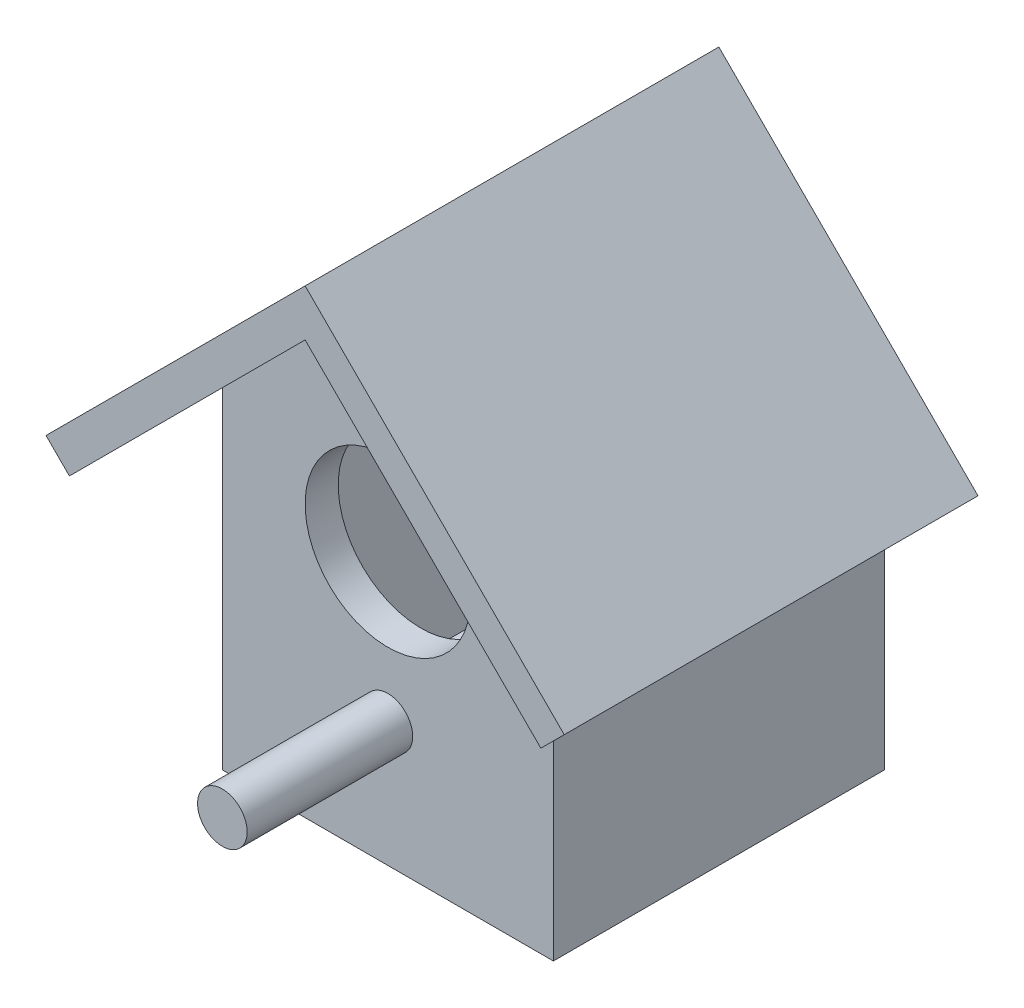
ISO-10303-21;
HEADER;
FILE_DESCRIPTION(('STEP AP214'),'2;1');
FILE_NAME('part.step','',(''),(''),'','','');
FILE_SCHEMA(('AUTOMOTIVE_DESIGN { 1 0 10303 214 1 1 1 1 }'));
ENDSEC;
DATA;
#1=APPLICATION_CONTEXT('core data for automotive mechanical design processes');
#2=APPLICATION_PROTOCOL_DEFINITION('international standard','automotive_design',2000,#1);
#3=PRODUCT_CONTEXT('',#1,'mechanical');
#4=PRODUCT('Part','Part','',(#3));
#5=PRODUCT_RELATED_PRODUCT_CATEGORY('part','',(#4));
#6=PRODUCT_DEFINITION_FORMATION('','',#4);
#7=PRODUCT_DEFINITION_CONTEXT('part definition',#1,'design');
#8=PRODUCT_DEFINITION('design','',#6,#7);
#9=PRODUCT_DEFINITION_SHAPE('','',#8);
#10=(LENGTH_UNIT() NAMED_UNIT(*) SI_UNIT(.MILLI.,.METRE.));
#11=(NAMED_UNIT(*) PLANE_ANGLE_UNIT() SI_UNIT($,.RADIAN.));
#12=(NAMED_UNIT(*) SI_UNIT($,.STERADIAN.) SOLID_ANGLE_UNIT());
#13=UNCERTAINTY_MEASURE_WITH_UNIT(LENGTH_MEASURE(1.E-05),#10,'distance_accuracy_value','');
#14=(GEOMETRIC_REPRESENTATION_CONTEXT(3) GLOBAL_UNCERTAINTY_ASSIGNED_CONTEXT((#13)) GLOBAL_UNIT_ASSIGNED_CONTEXT((#10,
#11,#12)) REPRESENTATION_CONTEXT('',''));
#15=CARTESIAN_POINT('',(0.,0.,0.));
#16=DIRECTION('',(0.,0.,1.));
#17=DIRECTION('',(1.,0.,0.));
#18=AXIS2_PLACEMENT_3D('',#15,#16,#17);
#19=CARTESIAN_POINT('',(100.,75.,180.));
#20=DIRECTION('',(0.,0.,1.));
#21=DIRECTION('',(1.,0.,0.));
#22=AXIS2_PLACEMENT_3D('',#19,#20,#21);
#23=CYLINDRICAL_SURFACE('',#22,15.);
#24=CARTESIAN_POINT('',(100.,75.,180.));
#25=DIRECTION('',(0.,0.,1.));
#26=DIRECTION('',(1.,0.,0.));
#27=AXIS2_PLACEMENT_3D('',#24,#25,#26);
#28=CIRCLE('',#27,15.);
#29=CARTESIAN_POINT('',(115.,75.,180.));
#30=VERTEX_POINT('',#29);
#31=EDGE_CURVE('E11',#30,#30,#28,.T.);
#32=ORIENTED_EDGE('',*,*,#31,.T.);
#33=EDGE_LOOP('',(#32));
#34=FACE_BOUND('',#33,.T.);
#35=CARTESIAN_POINT('',(100.,75.,300.));
#36=DIRECTION('',(0.,0.,1.));
#37=DIRECTION('',(1.,0.,0.));
#38=AXIS2_PLACEMENT_3D('',#35,#36,#37);
#39=CIRCLE('',#38,15.);
#40=CARTESIAN_POINT('',(115.,75.,300.));
#41=VERTEX_POINT('',#40);
#42=EDGE_CURVE('E49',#41,#41,#39,.T.);
#43=ORIENTED_EDGE('',*,*,#42,.F.);
#44=EDGE_LOOP('',(#43));
#45=FACE_BOUND('',#44,.T.);
#46=ADVANCED_FACE('F43',(#34,#45),#23,.T.);
#47=CARTESIAN_POINT('',(100.,75.,180.));
#48=DIRECTION('',(0.,0.,1.));
#49=DIRECTION('',(1.,0.,0.));
#50=AXIS2_PLACEMENT_3D('',#47,#48,#49);
#51=PLANE('',#50);
#52=ORIENTED_EDGE('',*,*,#31,.F.);
#53=EDGE_LOOP('',(#52));
#54=FACE_BOUND('',#53,.T.);
#55=ADVANCED_FACE('F58',(#54),#51,.F.);
#56=CARTESIAN_POINT('',(100.,75.,300.));
#57=DIRECTION('',(0.,0.,1.));
#58=DIRECTION('',(1.,0.,0.));
#59=AXIS2_PLACEMENT_3D('',#56,#57,#58);
#60=PLANE('',#59);
#61=ORIENTED_EDGE('',*,*,#42,.T.);
#62=EDGE_LOOP('',(#61));
#63=FACE_BOUND('',#62,.T.);
#64=ADVANCED_FACE('F55',(#63),#60,.T.);
#65=CLOSED_SHELL('',(#46,#55,#64));
#66=MANIFOLD_SOLID_BREP('B2',#65);
#67=CARTESIAN_POINT('',(180.,0.,200.));
#68=DIRECTION('',(-1.,0.,0.));
#69=DIRECTION('',(0.,0.,1.));
#70=AXIS2_PLACEMENT_3D('',#67,#68,#69);
#71=PLANE('',#70);
#72=DIRECTION('',(0.,0.,-1.));
#73=VECTOR('',#72,1.);
#74=CARTESIAN_POINT('',(180.,20.,200.));
#75=LINE('',#74,#73);
#76=CARTESIAN_POINT('',(180.,20.,180.));
#77=VERTEX_POINT('',#76);
#78=CARTESIAN_POINT('',(180.,20.,20.));
#79=VERTEX_POINT('',#78);
#80=EDGE_CURVE('E281',#77,#79,#75,.T.);
#81=ORIENTED_EDGE('',*,*,#80,.F.);
#82=DIRECTION('',(0.,1.,0.));
#83=VECTOR('',#82,1.);
#84=CARTESIAN_POINT('',(180.,0.,180.));
#85=LINE('',#84,#83);
#86=CARTESIAN_POINT('',(180.,220.,180.));
#87=VERTEX_POINT('',#86);
#88=EDGE_CURVE('E241',#77,#87,#85,.T.);
#89=ORIENTED_EDGE('',*,*,#88,.T.);
#90=DIRECTION('',(0.,0.,-1.));
#91=VECTOR('',#90,1.);
#92=CARTESIAN_POINT('',(180.,220.,200.));
#93=LINE('',#92,#91);
#94=CARTESIAN_POINT('',(180.,220.,20.));
#95=VERTEX_POINT('',#94);
#96=EDGE_CURVE('E99',#87,#95,#93,.T.);
#97=ORIENTED_EDGE('',*,*,#96,.T.);
#98=DIRECTION('',(0.,1.,0.));
#99=VECTOR('',#98,1.);
#100=CARTESIAN_POINT('',(180.,0.,20.));
#101=LINE('',#100,#99);
#102=EDGE_CURVE('E286',#79,#95,#101,.T.);
#103=ORIENTED_EDGE('',*,*,#102,.F.);
#104=EDGE_LOOP('',(#81,#89,#97,#103));
#105=FACE_BOUND('',#104,.T.);
#106=ADVANCED_FACE('F84',(#105),#71,.T.);
#107=CARTESIAN_POINT('',(0.,20.,200.));
#108=DIRECTION('',(0.,1.,0.));
#109=DIRECTION('',(0.,0.,1.));
#110=AXIS2_PLACEMENT_3D('',#107,#108,#109);
#111=PLANE('',#110);
#112=DIRECTION('',(0.,0.,-1.));
#113=VECTOR('',#112,1.);
#114=CARTESIAN_POINT('',(20.0000000000003,20.,200.));
#115=LINE('',#114,#113);
#116=CARTESIAN_POINT('',(20.0000000000003,20.,180.));
#117=VERTEX_POINT('',#116);
#118=CARTESIAN_POINT('',(20.0000000000003,20.,20.));
#119=VERTEX_POINT('',#118);
#120=EDGE_CURVE('E279',#117,#119,#115,.T.);
#121=ORIENTED_EDGE('',*,*,#120,.F.);
#122=DIRECTION('',(1.,0.,0.));
#123=VECTOR('',#122,1.);
#124=CARTESIAN_POINT('',(0.,20.,180.));
#125=LINE('',#124,#123);
#126=EDGE_CURVE('E107',#117,#77,#125,.T.);
#127=ORIENTED_EDGE('',*,*,#126,.T.);
#128=ORIENTED_EDGE('',*,*,#80,.T.);
#129=DIRECTION('',(1.,0.,0.));
#130=VECTOR('',#129,1.);
#131=CARTESIAN_POINT('',(0.,20.,20.));
#132=LINE('',#131,#130);
#133=EDGE_CURVE('E283',#119,#79,#132,.T.);
#134=ORIENTED_EDGE('',*,*,#133,.F.);
#135=EDGE_LOOP('',(#121,#127,#128,#134));
#136=FACE_BOUND('',#135,.T.);
#137=ADVANCED_FACE('F309',(#136),#111,.T.);
#138=CARTESIAN_POINT('',(20.0000000000003,0.,200.));
#139=DIRECTION('',(1.,0.,0.));
#140=DIRECTION('',(0.,1.,0.));
#141=AXIS2_PLACEMENT_3D('',#138,#139,#140);
#142=PLANE('',#141);
#143=DIRECTION('',(0.,0.,-1.));
#144=VECTOR('',#143,1.);
#145=CARTESIAN_POINT('',(20.0000000000003,220.,200.));
#146=LINE('',#145,#144);
#147=CARTESIAN_POINT('',(20.0000000000003,220.,180.));
#148=VERTEX_POINT('',#147);
#149=CARTESIAN_POINT('',(20.0000000000003,220.,20.));
#150=VERTEX_POINT('',#149);
#151=EDGE_CURVE('E277',#148,#150,#146,.T.);
#152=ORIENTED_EDGE('',*,*,#151,.F.);
#153=DIRECTION('',(0.,-1.,0.));
#154=VECTOR('',#153,1.);
#155=CARTESIAN_POINT('',(20.0000000000003,0.,180.));
#156=LINE('',#155,#154);
#157=EDGE_CURVE('E234',#148,#117,#156,.T.);
#158=ORIENTED_EDGE('',*,*,#157,.T.);
#159=ORIENTED_EDGE('',*,*,#120,.T.);
#160=DIRECTION('',(0.,-1.,0.));
#161=VECTOR('',#160,1.);
#162=CARTESIAN_POINT('',(20.0000000000003,0.,20.));
#163=LINE('',#162,#161);
#164=EDGE_CURVE('E41',#150,#119,#163,.T.);
#165=ORIENTED_EDGE('',*,*,#164,.F.);
#166=EDGE_LOOP('',(#152,#158,#159,#165));
#167=FACE_BOUND('',#166,.T.);
#168=ADVANCED_FACE('F308',(#167),#142,.T.);
#169=CARTESIAN_POINT('',(0.,0.,20.));
#170=DIRECTION('',(0.,0.,1.));
#171=DIRECTION('',(1.,0.,0.));
#172=AXIS2_PLACEMENT_3D('',#169,#170,#171);
#173=PLANE('',#172);
#174=ORIENTED_EDGE('',*,*,#133,.T.);
#175=ORIENTED_EDGE('',*,*,#102,.T.);
#176=DIRECTION('',(0.707106781186546,-0.707106781186549,0.));
#177=VECTOR('',#176,1.);
#178=CARTESIAN_POINT('',(200.,200.,20.));
#179=LINE('',#178,#177);
#180=CARTESIAN_POINT('',(100.,300.,20.));
#181=VERTEX_POINT('',#180);
#182=EDGE_CURVE('E289',#181,#95,#179,.T.);
#183=ORIENTED_EDGE('',*,*,#182,.F.);
#184=DIRECTION('',(0.707106781186546,0.707106781186549,0.));
#185=VECTOR('',#184,1.);
#186=CARTESIAN_POINT('',(-100.,99.9999999999997,20.));
#187=LINE('',#186,#185);
#188=EDGE_CURVE('E92',#150,#181,#187,.T.);
#189=ORIENTED_EDGE('',*,*,#188,.F.);
#190=ORIENTED_EDGE('',*,*,#164,.T.);
#191=EDGE_LOOP('',(#174,#175,#183,#189,#190));
#192=FACE_BOUND('',#191,.T.);
#193=ADVANCED_FACE('F299',(#192),#173,.T.);
#194=CARTESIAN_POINT('',(0.,0.,0.));
#195=DIRECTION('',(0.,0.,1.));
#196=DIRECTION('',(1.,0.,0.));
#197=AXIS2_PLACEMENT_3D('',#194,#195,#196);
#198=PLANE('',#197);
#199=DIRECTION('',(0.,-1.,0.));
#200=VECTOR('',#199,1.);
#201=CARTESIAN_POINT('',(0.,0.,0.));
#202=LINE('',#201,#200);
#203=CARTESIAN_POINT('',(0.,200.,0.));
#204=VERTEX_POINT('',#203);
#205=CARTESIAN_POINT('',(0.,0.,0.));
#206=VERTEX_POINT('',#205);
#207=EDGE_CURVE('E236',#204,#206,#202,.T.);
#208=ORIENTED_EDGE('',*,*,#207,.F.);
#209=DIRECTION('',(0.707106781186546,0.707106781186549,0.));
#210=VECTOR('',#209,1.);
#211=CARTESIAN_POINT('',(-100.,99.9999999999997,0.));
#212=LINE('',#211,#210);
#213=CARTESIAN_POINT('',(-42.4264068711928,157.573593128807,0.));
#214=VERTEX_POINT('',#213);
#215=EDGE_CURVE('E334',#214,#204,#212,.T.);
#216=ORIENTED_EDGE('',*,*,#215,.F.);
#217=DIRECTION('',(0.707106781186548,-0.707106781186547,0.));
#218=VECTOR('',#217,1.);
#219=CARTESIAN_POINT('',(57.5735931288072,57.5735931288072,0.));
#220=LINE('',#219,#218);
#221=CARTESIAN_POINT('',(-56.5685424949238,171.715728752538,0.));
#222=VERTEX_POINT('',#221);
#223=EDGE_CURVE('E212',#222,#214,#220,.T.);
#224=ORIENTED_EDGE('',*,*,#223,.F.);
#225=DIRECTION('',(-0.707106781186547,-0.707106781186548,0.));
#226=VECTOR('',#225,1.);
#227=CARTESIAN_POINT('',(-114.142135623731,114.142135623731,0.));
#228=LINE('',#227,#226);
#229=CARTESIAN_POINT('',(100.,328.284271247462,0.));
#230=VERTEX_POINT('',#229);
#231=EDGE_CURVE('E348',#230,#222,#228,.T.);
#232=ORIENTED_EDGE('',*,*,#231,.F.);
#233=DIRECTION('',(-0.707106781186547,0.707106781186548,0.));
#234=VECTOR('',#233,1.);
#235=CARTESIAN_POINT('',(214.142135623731,214.142135623731,0.));
#236=LINE('',#235,#234);
#237=CARTESIAN_POINT('',(256.568542494924,171.715728752538,0.));
#238=VERTEX_POINT('',#237);
#239=EDGE_CURVE('E346',#238,#230,#236,.T.);
#240=ORIENTED_EDGE('',*,*,#239,.F.);
#241=DIRECTION('',(0.707106781186549,0.707106781186546,0.));
#242=VECTOR('',#241,1.);
#243=CARTESIAN_POINT('',(42.4264068711923,-42.4264068711925,0.));
#244=LINE('',#243,#242);
#245=CARTESIAN_POINT('',(242.426406871193,157.573593128807,0.));
#246=VERTEX_POINT('',#245);
#247=EDGE_CURVE('E340',#246,#238,#244,.T.);
#248=ORIENTED_EDGE('',*,*,#247,.F.);
#249=DIRECTION('',(0.707106781186546,-0.707106781186549,0.));
#250=VECTOR('',#249,1.);
#251=CARTESIAN_POINT('',(200.,200.,0.));
#252=LINE('',#251,#250);
#253=CARTESIAN_POINT('',(200.,200.,0.));
#254=VERTEX_POINT('',#253);
#255=EDGE_CURVE('E338',#254,#246,#252,.T.);
#256=ORIENTED_EDGE('',*,*,#255,.F.);
#257=DIRECTION('',(0.,1.,0.));
#258=VECTOR('',#257,1.);
#259=CARTESIAN_POINT('',(200.,0.,0.));
#260=LINE('',#259,#258);
#261=CARTESIAN_POINT('',(200.,0.,0.));
#262=VERTEX_POINT('',#261);
#263=EDGE_CURVE('E252',#262,#254,#260,.T.);
#264=ORIENTED_EDGE('',*,*,#263,.F.);
#265=DIRECTION('',(1.,0.,0.));
#266=VECTOR('',#265,1.);
#267=CARTESIAN_POINT('',(0.,0.,0.));
#268=LINE('',#267,#266);
#269=EDGE_CURVE('E262',#206,#262,#268,.T.);
#270=ORIENTED_EDGE('',*,*,#269,.F.);
#271=EDGE_LOOP('',(#208,#216,#224,#232,#240,#248,#256,#264,#270));
#272=FACE_BOUND('',#271,.T.);
#273=ADVANCED_FACE('F86',(#272),#198,.F.);
#274=CARTESIAN_POINT('',(0.,0.,200.));
#275=DIRECTION('',(1.,0.,0.));
#276=DIRECTION('',(0.,1.,0.));
#277=AXIS2_PLACEMENT_3D('',#274,#275,#276);
#278=PLANE('',#277);
#279=ORIENTED_EDGE('',*,*,#207,.T.);
#280=DIRECTION('',(0.,0.,-1.));
#281=VECTOR('',#280,1.);
#282=CARTESIAN_POINT('',(0.,0.,200.));
#283=LINE('',#282,#281);
#284=CARTESIAN_POINT('',(0.,0.,200.));
#285=VERTEX_POINT('',#284);
#286=EDGE_CURVE('E272',#285,#206,#283,.T.);
#287=ORIENTED_EDGE('',*,*,#286,.F.);
#288=DIRECTION('',(0.,-1.,0.));
#289=VECTOR('',#288,1.);
#290=CARTESIAN_POINT('',(0.,0.,200.));
#291=LINE('',#290,#289);
#292=CARTESIAN_POINT('',(0.,200.,200.));
#293=VERTEX_POINT('',#292);
#294=EDGE_CURVE('E251',#293,#285,#291,.T.);
#295=ORIENTED_EDGE('',*,*,#294,.F.);
#296=DIRECTION('',(0.,0.,-1.));
#297=VECTOR('',#296,1.);
#298=CARTESIAN_POINT('',(0.,200.,200.));
#299=LINE('',#298,#297);
#300=EDGE_CURVE('E275',#293,#204,#299,.T.);
#301=ORIENTED_EDGE('',*,*,#300,.T.);
#302=EDGE_LOOP('',(#279,#287,#295,#301));
#303=FACE_BOUND('',#302,.T.);
#304=ADVANCED_FACE('F323',(#303),#278,.F.);
#305=CARTESIAN_POINT('',(0.,0.,200.));
#306=DIRECTION('',(0.,1.,0.));
#307=DIRECTION('',(0.,0.,1.));
#308=AXIS2_PLACEMENT_3D('',#305,#306,#307);
#309=PLANE('',#308);
#310=ORIENTED_EDGE('',*,*,#269,.T.);
#311=DIRECTION('',(0.,0.,-1.));
#312=VECTOR('',#311,1.);
#313=CARTESIAN_POINT('',(200.,0.,200.));
#314=LINE('',#313,#312);
#315=CARTESIAN_POINT('',(200.,0.,200.));
#316=VERTEX_POINT('',#315);
#317=EDGE_CURVE('E269',#316,#262,#314,.T.);
#318=ORIENTED_EDGE('',*,*,#317,.F.);
#319=DIRECTION('',(1.,0.,0.));
#320=VECTOR('',#319,1.);
#321=CARTESIAN_POINT('',(0.,0.,200.));
#322=LINE('',#321,#320);
#323=EDGE_CURVE('E254',#285,#316,#322,.T.);
#324=ORIENTED_EDGE('',*,*,#323,.F.);
#325=ORIENTED_EDGE('',*,*,#286,.T.);
#326=EDGE_LOOP('',(#310,#318,#324,#325));
#327=FACE_BOUND('',#326,.T.);
#328=ADVANCED_FACE('F328',(#327),#309,.F.);
#329=CARTESIAN_POINT('',(200.,0.,200.));
#330=DIRECTION('',(-1.,0.,0.));
#331=DIRECTION('',(0.,0.,1.));
#332=AXIS2_PLACEMENT_3D('',#329,#330,#331);
#333=PLANE('',#332);
#334=ORIENTED_EDGE('',*,*,#263,.T.);
#335=DIRECTION('',(0.,0.,-1.));
#336=VECTOR('',#335,1.);
#337=CARTESIAN_POINT('',(200.,200.,200.));
#338=LINE('',#337,#336);
#339=CARTESIAN_POINT('',(200.,200.,200.));
#340=VERTEX_POINT('',#339);
#341=EDGE_CURVE('E266',#340,#254,#338,.T.);
#342=ORIENTED_EDGE('',*,*,#341,.F.);
#343=DIRECTION('',(0.,1.,0.));
#344=VECTOR('',#343,1.);
#345=CARTESIAN_POINT('',(200.,0.,200.));
#346=LINE('',#345,#344);
#347=EDGE_CURVE('E256',#316,#340,#346,.T.);
#348=ORIENTED_EDGE('',*,*,#347,.F.);
#349=ORIENTED_EDGE('',*,*,#317,.T.);
#350=EDGE_LOOP('',(#334,#342,#348,#349));
#351=FACE_BOUND('',#350,.T.);
#352=ADVANCED_FACE('F411',(#351),#333,.F.);
#353=CARTESIAN_POINT('',(0.,0.,200.));
#354=DIRECTION('',(0.,0.,1.));
#355=DIRECTION('',(1.,0.,0.));
#356=AXIS2_PLACEMENT_3D('',#353,#354,#355);
#357=PLANE('',#356);
#358=DIRECTION('',(0.707106781186546,-0.707106781186549,0.));
#359=VECTOR('',#358,1.);
#360=CARTESIAN_POINT('',(200.,200.,200.));
#361=LINE('',#360,#359);
#362=CARTESIAN_POINT('',(100.,300.,200.));
#363=VERTEX_POINT('',#362);
#364=EDGE_CURVE('E259',#363,#340,#361,.T.);
#365=ORIENTED_EDGE('',*,*,#364,.F.);
#366=DIRECTION('',(0.707106781186546,0.707106781186549,0.));
#367=VECTOR('',#366,1.);
#368=CARTESIAN_POINT('',(-100.,99.9999999999997,200.));
#369=LINE('',#368,#367);
#370=EDGE_CURVE('E219',#293,#363,#369,.T.);
#371=ORIENTED_EDGE('',*,*,#370,.F.);
#372=ORIENTED_EDGE('',*,*,#294,.T.);
#373=ORIENTED_EDGE('',*,*,#323,.T.);
#374=ORIENTED_EDGE('',*,*,#347,.T.);
#375=EDGE_LOOP('',(#365,#371,#372,#373,#374));
#376=FACE_BOUND('',#375,.T.);
#377=CARTESIAN_POINT('',(100.,75.,200.));
#378=DIRECTION('',(0.,0.,1.));
#379=DIRECTION('',(1.,0.,0.));
#380=AXIS2_PLACEMENT_3D('',#377,#378,#379);
#381=CIRCLE('',#380,15.);
#382=CARTESIAN_POINT('',(115.,75.,200.));
#383=VERTEX_POINT('',#382);
#384=EDGE_CURVE('E230',#383,#383,#381,.T.);
#385=ORIENTED_EDGE('',*,*,#384,.F.);
#386=EDGE_LOOP('',(#385));
#387=FACE_BOUND('',#386,.T.);
#388=CARTESIAN_POINT('',(100.,164.142135623731,200.));
#389=DIRECTION('',(0.,0.,1.));
#390=DIRECTION('',(1.,0.,0.));
#391=AXIS2_PLACEMENT_3D('',#388,#389,#390);
#392=CIRCLE('',#391,50.);
#393=CARTESIAN_POINT('',(150.,164.142135623731,200.));
#394=VERTEX_POINT('',#393);
#395=EDGE_CURVE('E233',#394,#394,#392,.T.);
#396=ORIENTED_EDGE('',*,*,#395,.F.);
#397=EDGE_LOOP('',(#396));
#398=FACE_BOUND('',#397,.T.);
#399=ADVANCED_FACE('F404',(#376,#387,#398),#357,.T.);
#400=CARTESIAN_POINT('',(100.,164.142135623731,200.));
#401=DIRECTION('',(0.,0.,-1.));
#402=DIRECTION('',(-1.,0.,0.));
#403=AXIS2_PLACEMENT_3D('',#400,#401,#402);
#404=CYLINDRICAL_SURFACE('',#403,50.);
#405=ORIENTED_EDGE('',*,*,#395,.T.);
#406=EDGE_LOOP('',(#405));
#407=FACE_BOUND('',#406,.T.);
#408=CARTESIAN_POINT('',(100.,164.142135623731,180.));
#409=DIRECTION('',(0.,0.,1.));
#410=DIRECTION('',(1.,0.,0.));
#411=AXIS2_PLACEMENT_3D('',#408,#409,#410);
#412=CIRCLE('',#411,50.);
#413=CARTESIAN_POINT('',(150.,164.142135623731,180.));
#414=VERTEX_POINT('',#413);
#415=EDGE_CURVE('E224',#414,#414,#412,.T.);
#416=ORIENTED_EDGE('',*,*,#415,.F.);
#417=EDGE_LOOP('',(#416));
#418=FACE_BOUND('',#417,.T.);
#419=ADVANCED_FACE('F401',(#407,#418),#404,.F.);
#420=CARTESIAN_POINT('',(100.,75.,200.));
#421=DIRECTION('',(0.,0.,-1.));
#422=DIRECTION('',(-1.,0.,0.));
#423=AXIS2_PLACEMENT_3D('',#420,#421,#422);
#424=CYLINDRICAL_SURFACE('',#423,15.);
#425=ORIENTED_EDGE('',*,*,#384,.T.);
#426=EDGE_LOOP('',(#425));
#427=FACE_BOUND('',#426,.T.);
#428=CARTESIAN_POINT('',(100.,75.,180.));
#429=DIRECTION('',(0.,0.,1.));
#430=DIRECTION('',(1.,0.,0.));
#431=AXIS2_PLACEMENT_3D('',#428,#429,#430);
#432=CIRCLE('',#431,15.);
#433=CARTESIAN_POINT('',(115.,75.,180.));
#434=VERTEX_POINT('',#433);
#435=EDGE_CURVE('E220',#434,#434,#432,.T.);
#436=ORIENTED_EDGE('',*,*,#435,.F.);
#437=EDGE_LOOP('',(#436));
#438=FACE_BOUND('',#437,.T.);
#439=ADVANCED_FACE('F399',(#427,#438),#424,.F.);
#440=CARTESIAN_POINT('',(0.,0.,180.));
#441=DIRECTION('',(0.,0.,1.));
#442=DIRECTION('',(1.,0.,0.));
#443=AXIS2_PLACEMENT_3D('',#440,#441,#442);
#444=PLANE('',#443);
#445=ORIENTED_EDGE('',*,*,#435,.T.);
#446=EDGE_LOOP('',(#445));
#447=FACE_BOUND('',#446,.T.);
#448=ORIENTED_EDGE('',*,*,#415,.T.);
#449=EDGE_LOOP('',(#448));
#450=FACE_BOUND('',#449,.T.);
#451=ORIENTED_EDGE('',*,*,#126,.F.);
#452=ORIENTED_EDGE('',*,*,#157,.F.);
#453=DIRECTION('',(0.707106781186546,0.707106781186549,0.));
#454=VECTOR('',#453,1.);
#455=CARTESIAN_POINT('',(-100.,99.9999999999997,180.));
#456=LINE('',#455,#454);
#457=CARTESIAN_POINT('',(100.,300.,180.));
#458=VERTEX_POINT('',#457);
#459=EDGE_CURVE('E246',#148,#458,#456,.T.);
#460=ORIENTED_EDGE('',*,*,#459,.T.);
#461=DIRECTION('',(0.707106781186546,-0.707106781186549,0.));
#462=VECTOR('',#461,1.);
#463=CARTESIAN_POINT('',(200.,200.,180.));
#464=LINE('',#463,#462);
#465=EDGE_CURVE('E243',#458,#87,#464,.T.);
#466=ORIENTED_EDGE('',*,*,#465,.T.);
#467=ORIENTED_EDGE('',*,*,#88,.F.);
#468=EDGE_LOOP('',(#451,#452,#460,#466,#467));
#469=FACE_BOUND('',#468,.T.);
#470=ADVANCED_FACE('F305',(#447,#450,#469),#444,.F.);
#471=CARTESIAN_POINT('',(200.,200.,250.));
#472=DIRECTION('',(0.707106781186549,0.707106781186546,0.));
#473=DIRECTION('',(-0.707106781186546,0.707106781186549,0.));
#474=AXIS2_PLACEMENT_3D('',#471,#472,#473);
#475=PLANE('',#474);
#476=ORIENTED_EDGE('',*,*,#182,.T.);
#477=ORIENTED_EDGE('',*,*,#96,.F.);
#478=ORIENTED_EDGE('',*,*,#465,.F.);
#479=DIRECTION('',(0.,0.,-1.));
#480=VECTOR('',#479,1.);
#481=CARTESIAN_POINT('',(100.,300.,250.));
#482=LINE('',#481,#480);
#483=EDGE_CURVE('E221',#458,#181,#482,.T.);
#484=ORIENTED_EDGE('',*,*,#483,.T.);
#485=EDGE_LOOP('',(#476,#477,#478,#484));
#486=FACE_BOUND('',#485,.T.);
#487=ADVANCED_FACE('F298',(#486),#475,.F.);
#488=CARTESIAN_POINT('',(-100.,99.9999999999997,250.));
#489=DIRECTION('',(-0.707106781186549,0.707106781186546,0.));
#490=DIRECTION('',(-0.707106781186546,-0.707106781186549,0.));
#491=AXIS2_PLACEMENT_3D('',#488,#489,#490);
#492=PLANE('',#491);
#493=ORIENTED_EDGE('',*,*,#188,.T.);
#494=ORIENTED_EDGE('',*,*,#483,.F.);
#495=ORIENTED_EDGE('',*,*,#459,.F.);
#496=ORIENTED_EDGE('',*,*,#151,.T.);
#497=EDGE_LOOP('',(#493,#494,#495,#496));
#498=FACE_BOUND('',#497,.T.);
#499=ADVANCED_FACE('F293',(#498),#492,.F.);
#500=ORIENTED_EDGE('',*,*,#215,.T.);
#501=ORIENTED_EDGE('',*,*,#300,.F.);
#502=ORIENTED_EDGE('',*,*,#370,.T.);
#503=CARTESIAN_POINT('',(100.,300.,250.));
#504=VERTEX_POINT('',#503);
#505=EDGE_CURVE('E197',#504,#363,#482,.T.);
#506=ORIENTED_EDGE('',*,*,#505,.F.);
#507=DIRECTION('',(0.707106781186546,0.707106781186549,0.));
#508=VECTOR('',#507,1.);
#509=CARTESIAN_POINT('',(-100.,99.9999999999997,250.));
#510=LINE('',#509,#508);
#511=CARTESIAN_POINT('',(-42.4264068711928,157.573593128807,250.));
#512=VERTEX_POINT('',#511);
#513=EDGE_CURVE('E203',#512,#504,#510,.T.);
#514=ORIENTED_EDGE('',*,*,#513,.F.);
#515=DIRECTION('',(0.,0.,-1.));
#516=VECTOR('',#515,1.);
#517=CARTESIAN_POINT('',(-42.4264068711928,157.573593128807,250.));
#518=LINE('',#517,#516);
#519=EDGE_CURVE('E337',#512,#214,#518,.T.);
#520=ORIENTED_EDGE('',*,*,#519,.T.);
#521=EDGE_LOOP('',(#500,#501,#502,#506,#514,#520));
#522=FACE_BOUND('',#521,.T.);
#523=ADVANCED_FACE('F216',(#522),#492,.F.);
#524=ORIENTED_EDGE('',*,*,#364,.T.);
#525=ORIENTED_EDGE('',*,*,#341,.T.);
#526=ORIENTED_EDGE('',*,*,#255,.T.);
#527=DIRECTION('',(0.,0.,-1.));
#528=VECTOR('',#527,1.);
#529=CARTESIAN_POINT('',(242.426406871193,157.573593128807,250.));
#530=LINE('',#529,#528);
#531=CARTESIAN_POINT('',(242.426406871193,157.573593128807,250.));
#532=VERTEX_POINT('',#531);
#533=EDGE_CURVE('E199',#532,#246,#530,.T.);
#534=ORIENTED_EDGE('',*,*,#533,.F.);
#535=DIRECTION('',(0.707106781186546,-0.707106781186549,0.));
#536=VECTOR('',#535,1.);
#537=CARTESIAN_POINT('',(200.,200.,250.));
#538=LINE('',#537,#536);
#539=EDGE_CURVE('E192',#504,#532,#538,.T.);
#540=ORIENTED_EDGE('',*,*,#539,.F.);
#541=ORIENTED_EDGE('',*,*,#505,.T.);
#542=EDGE_LOOP('',(#524,#525,#526,#534,#540,#541));
#543=FACE_BOUND('',#542,.T.);
#544=ADVANCED_FACE('F195',(#543),#475,.F.);
#545=CARTESIAN_POINT('',(42.4264068711923,-42.4264068711925,250.));
#546=DIRECTION('',(-0.707106781186546,0.707106781186549,0.));
#547=DIRECTION('',(-0.707106781186549,-0.707106781186546,0.));
#548=AXIS2_PLACEMENT_3D('',#545,#546,#547);
#549=PLANE('',#548);
#550=ORIENTED_EDGE('',*,*,#247,.T.);
#551=DIRECTION('',(0.,0.,-1.));
#552=VECTOR('',#551,1.);
#553=CARTESIAN_POINT('',(256.568542494924,171.715728752538,250.));
#554=LINE('',#553,#552);
#555=CARTESIAN_POINT('',(256.568542494924,171.715728752538,250.));
#556=VERTEX_POINT('',#555);
#557=EDGE_CURVE('E357',#556,#238,#554,.T.);
#558=ORIENTED_EDGE('',*,*,#557,.F.);
#559=DIRECTION('',(0.707106781186549,0.707106781186546,0.));
#560=VECTOR('',#559,1.);
#561=CARTESIAN_POINT('',(42.4264068711923,-42.4264068711925,250.));
#562=LINE('',#561,#560);
#563=EDGE_CURVE('E202',#532,#556,#562,.T.);
#564=ORIENTED_EDGE('',*,*,#563,.F.);
#565=ORIENTED_EDGE('',*,*,#533,.T.);
#566=EDGE_LOOP('',(#550,#558,#564,#565));
#567=FACE_BOUND('',#566,.T.);
#568=ADVANCED_FACE('F365',(#567),#549,.F.);
#569=CARTESIAN_POINT('',(214.142135623731,214.142135623731,250.));
#570=DIRECTION('',(-0.707106781186548,-0.707106781186547,0.));
#571=DIRECTION('',(0.707106781186547,-0.707106781186548,0.));
#572=AXIS2_PLACEMENT_3D('',#569,#570,#571);
#573=PLANE('',#572);
#574=ORIENTED_EDGE('',*,*,#239,.T.);
#575=DIRECTION('',(0.,0.,-1.));
#576=VECTOR('',#575,1.);
#577=CARTESIAN_POINT('',(100.,328.284271247462,250.));
#578=LINE('',#577,#576);
#579=CARTESIAN_POINT('',(100.,328.284271247462,250.));
#580=VERTEX_POINT('',#579);
#581=EDGE_CURVE('E355',#580,#230,#578,.T.);
#582=ORIENTED_EDGE('',*,*,#581,.F.);
#583=DIRECTION('',(-0.707106781186547,0.707106781186548,0.));
#584=VECTOR('',#583,1.);
#585=CARTESIAN_POINT('',(214.142135623731,214.142135623731,250.));
#586=LINE('',#585,#584);
#587=EDGE_CURVE('E375',#556,#580,#586,.T.);
#588=ORIENTED_EDGE('',*,*,#587,.F.);
#589=ORIENTED_EDGE('',*,*,#557,.T.);
#590=EDGE_LOOP('',(#574,#582,#588,#589));
#591=FACE_BOUND('',#590,.T.);
#592=ADVANCED_FACE('F369',(#591),#573,.F.);
#593=CARTESIAN_POINT('',(-114.142135623731,114.142135623731,250.));
#594=DIRECTION('',(0.707106781186548,-0.707106781186547,0.));
#595=DIRECTION('',(0.707106781186547,0.707106781186548,0.));
#596=AXIS2_PLACEMENT_3D('',#593,#594,#595);
#597=PLANE('',#596);
#598=ORIENTED_EDGE('',*,*,#231,.T.);
#599=DIRECTION('',(0.,0.,-1.));
#600=VECTOR('',#599,1.);
#601=CARTESIAN_POINT('',(-56.5685424949238,171.715728752538,250.));
#602=LINE('',#601,#600);
#603=CARTESIAN_POINT('',(-56.5685424949238,171.715728752538,250.));
#604=VERTEX_POINT('',#603);
#605=EDGE_CURVE('E352',#604,#222,#602,.T.);
#606=ORIENTED_EDGE('',*,*,#605,.F.);
#607=DIRECTION('',(-0.707106781186547,-0.707106781186548,0.));
#608=VECTOR('',#607,1.);
#609=CARTESIAN_POINT('',(-114.142135623731,114.142135623731,250.));
#610=LINE('',#609,#608);
#611=EDGE_CURVE('E374',#580,#604,#610,.T.);
#612=ORIENTED_EDGE('',*,*,#611,.F.);
#613=ORIENTED_EDGE('',*,*,#581,.T.);
#614=EDGE_LOOP('',(#598,#606,#612,#613));
#615=FACE_BOUND('',#614,.T.);
#616=ADVANCED_FACE('F372',(#615),#597,.F.);
#617=CARTESIAN_POINT('',(57.5735931288072,57.5735931288072,250.));
#618=DIRECTION('',(0.707106781186547,0.707106781186548,0.));
#619=DIRECTION('',(-0.707106781186548,0.707106781186547,0.));
#620=AXIS2_PLACEMENT_3D('',#617,#618,#619);
#621=PLANE('',#620);
#622=ORIENTED_EDGE('',*,*,#223,.T.);
#623=ORIENTED_EDGE('',*,*,#519,.F.);
#624=DIRECTION('',(0.707106781186548,-0.707106781186547,0.));
#625=VECTOR('',#624,1.);
#626=CARTESIAN_POINT('',(57.5735931288072,57.5735931288072,250.));
#627=LINE('',#626,#625);
#628=EDGE_CURVE('E208',#604,#512,#627,.T.);
#629=ORIENTED_EDGE('',*,*,#628,.F.);
#630=ORIENTED_EDGE('',*,*,#605,.T.);
#631=EDGE_LOOP('',(#622,#623,#629,#630));
#632=FACE_BOUND('',#631,.T.);
#633=ADVANCED_FACE('F379',(#632),#621,.F.);
#634=CARTESIAN_POINT('',(0.,0.,250.));
#635=DIRECTION('',(0.,0.,1.));
#636=DIRECTION('',(1.,0.,0.));
#637=AXIS2_PLACEMENT_3D('',#634,#635,#636);
#638=PLANE('',#637);
#639=ORIENTED_EDGE('',*,*,#513,.T.);
#640=ORIENTED_EDGE('',*,*,#539,.T.);
#641=ORIENTED_EDGE('',*,*,#563,.T.);
#642=ORIENTED_EDGE('',*,*,#587,.T.);
#643=ORIENTED_EDGE('',*,*,#611,.T.);
#644=ORIENTED_EDGE('',*,*,#628,.T.);
#645=EDGE_LOOP('',(#639,#640,#641,#642,#643,#644));
#646=FACE_BOUND('',#645,.T.);
#647=ADVANCED_FACE('F206',(#646),#638,.T.);
#648=CLOSED_SHELL('',(#106,#137,#168,#193,#273,#304,#328,#352,#399,#419,#439,#470,#487,#499,
#523,#544,#568,#592,#616,#633,#647));
#649=MANIFOLD_SOLID_BREP('B6',#648);
#650=ADVANCED_BREP_SHAPE_REPRESENTATION('',(#18,#66,#649),#14);
#651=SHAPE_DEFINITION_REPRESENTATION(#9,#650);
ENDSEC;
END-ISO-10303-21;
